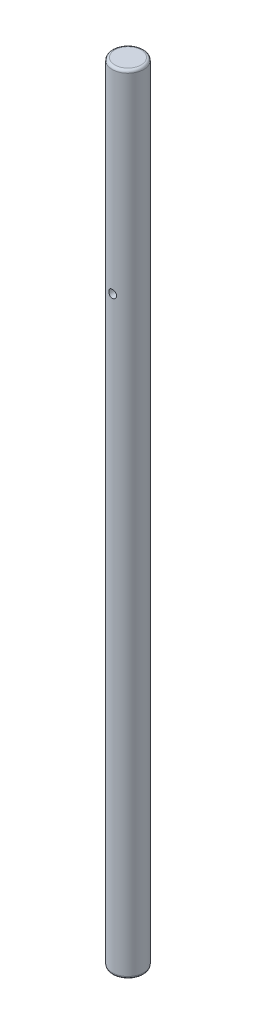
ISO-10303-21;
HEADER;
FILE_DESCRIPTION(('STEP AP214'),'2;1');
FILE_NAME('part.step','',(''),(''),'','','');
FILE_SCHEMA(('AUTOMOTIVE_DESIGN { 1 0 10303 214 1 1 1 1 }'));
ENDSEC;
DATA;
#1=APPLICATION_CONTEXT('core data for automotive mechanical design processes');
#2=APPLICATION_PROTOCOL_DEFINITION('international standard','automotive_design',2000,#1);
#3=PRODUCT_CONTEXT('',#1,'mechanical');
#4=PRODUCT('Part','Part','',(#3));
#5=PRODUCT_RELATED_PRODUCT_CATEGORY('part','',(#4));
#6=PRODUCT_DEFINITION_FORMATION('','',#4);
#7=PRODUCT_DEFINITION_CONTEXT('part definition',#1,'design');
#8=PRODUCT_DEFINITION('design','',#6,#7);
#9=PRODUCT_DEFINITION_SHAPE('','',#8);
#10=(LENGTH_UNIT() NAMED_UNIT(*) SI_UNIT(.MILLI.,.METRE.));
#11=(NAMED_UNIT(*) PLANE_ANGLE_UNIT() SI_UNIT($,.RADIAN.));
#12=(NAMED_UNIT(*) SI_UNIT($,.STERADIAN.) SOLID_ANGLE_UNIT());
#13=UNCERTAINTY_MEASURE_WITH_UNIT(LENGTH_MEASURE(1.E-05),#10,'distance_accuracy_value','');
#14=(GEOMETRIC_REPRESENTATION_CONTEXT(3) GLOBAL_UNCERTAINTY_ASSIGNED_CONTEXT((#13)) GLOBAL_UNIT_ASSIGNED_CONTEXT((#10,
#11,#12)) REPRESENTATION_CONTEXT('',''));
#15=CARTESIAN_POINT('',(0.,0.,0.));
#16=DIRECTION('',(0.,0.,1.));
#17=DIRECTION('',(1.,0.,0.));
#18=AXIS2_PLACEMENT_3D('',#15,#16,#17);
#19=CARTESIAN_POINT('',(0.,300.,0.));
#20=DIRECTION('',(0.,-1.,0.));
#21=DIRECTION('',(0.,0.,-1.));
#22=AXIS2_PLACEMENT_3D('',#19,#20,#21);
#23=CYLINDRICAL_SURFACE('',#22,6.);
#24=CARTESIAN_POINT('',(0.,226.5,-6.));
#25=CARTESIAN_POINT('',(-0.0828760886697318,226.499997674262,-5.99999859868013));
#26=CARTESIAN_POINT('',(-0.165778157830765,226.493108449226,-5.99826578131828));
#27=CARTESIAN_POINT('',(-0.329206323770534,226.465774848693,-5.99152113829892));
#28=CARTESIAN_POINT('',(-0.409731046870738,226.445322790462,-5.98650745419968));
#29=CARTESIAN_POINT('',(-0.566020872182574,226.391560746538,-5.9737562633204));
#30=CARTESIAN_POINT('',(-0.64179156343,226.358266201285,-5.96602202842087));
#31=CARTESIAN_POINT('',(-0.786672131904421,226.279818609955,-5.94865343807593));
#32=CARTESIAN_POINT('',(-0.855781784348752,226.234665163881,-5.93901901854051));
#33=CARTESIAN_POINT('',(-0.986801927300911,226.132799210346,-5.91867413591801));
#34=CARTESIAN_POINT('',(-1.04855569006106,226.075888425041,-5.90794707148533));
#35=CARTESIAN_POINT('',(-1.1617489272033,225.952547795091,-5.8867362011753));
#36=CARTESIAN_POINT('',(-1.21318723694913,225.886116877054,-5.87625242288349));
#37=CARTESIAN_POINT('',(-1.30502654279903,225.744404773263,-5.85654775699711));
#38=CARTESIAN_POINT('',(-1.34525221592535,225.66900676919,-5.84734794470605));
#39=CARTESIAN_POINT('',(-1.41239690855053,225.512251588342,-5.83149494812223));
#40=CARTESIAN_POINT('',(-1.43931805543933,225.430895366674,-5.82484135672789));
#41=CARTESIAN_POINT('',(-1.47855483680429,225.266256501798,-5.81500476717551));
#42=CARTESIAN_POINT('',(-1.49115226833334,225.18304510395,-5.81175491075426));
#43=CARTESIAN_POINT('',(-1.50226177506785,225.015631430986,-5.80889362537741));
#44=CARTESIAN_POINT('',(-1.50077614181798,224.931429319301,-5.80928160448644));
#45=CARTESIAN_POINT('',(-1.48398652463928,224.766584192255,-5.81359205496618));
#46=CARTESIAN_POINT('',(-1.46901834019052,224.685904378535,-5.81742863001879));
#47=CARTESIAN_POINT('',(-1.4262241869031,224.528238949089,-5.82806709676484));
#48=CARTESIAN_POINT('',(-1.39839730206941,224.451253596971,-5.83486919970697));
#49=CARTESIAN_POINT('',(-1.33038947793714,224.302261983748,-5.85075113904187));
#50=CARTESIAN_POINT('',(-1.29008666723289,224.23031382821,-5.85985327469422));
#51=CARTESIAN_POINT('',(-1.19835627601494,224.094081290243,-5.87929710846386));
#52=CARTESIAN_POINT('',(-1.14692674880883,224.029798251933,-5.88963902334736));
#53=CARTESIAN_POINT('',(-1.03266342468121,223.908796384306,-5.91075880539781));
#54=CARTESIAN_POINT('',(-0.969546258165863,223.852345509939,-5.92154069477971));
#55=CARTESIAN_POINT('',(-0.834611917503708,223.750778757536,-5.94205965578786));
#56=CARTESIAN_POINT('',(-0.76279447770795,223.705663225736,-5.95179669549415));
#57=CARTESIAN_POINT('',(-0.612115888681398,223.627949413776,-5.96917732094183));
#58=CARTESIAN_POINT('',(-0.533231393208632,223.595394659746,-5.97681360127725));
#59=CARTESIAN_POINT('',(-0.37087600814289,223.54408269429,-5.98907916991418));
#60=CARTESIAN_POINT('',(-0.287405999150489,223.525322843582,-5.99370903339281));
#61=CARTESIAN_POINT('',(-0.120539970390027,223.502542434441,-5.99935499271375));
#62=CARTESIAN_POINT('',(-0.0371967199882095,223.498156973925,-6.00046053508279));
#63=CARTESIAN_POINT('',(0.129032874801509,223.503249002055,-5.99918804814451));
#64=CARTESIAN_POINT('',(0.211919259644596,223.512725242799,-5.99681033241847));
#65=CARTESIAN_POINT('',(0.373614268776496,223.544970908391,-5.98889581127357));
#66=CARTESIAN_POINT('',(0.452465118968762,223.567541263477,-5.98340634185811));
#67=CARTESIAN_POINT('',(0.605257292452516,223.625107084028,-5.96988706634134));
#68=CARTESIAN_POINT('',(0.679198119032633,223.660103804313,-5.96185700369892));
#69=CARTESIAN_POINT('',(0.821523134429846,223.742236128875,-5.9439330792631));
#70=CARTESIAN_POINT('',(0.889785441835833,223.789576112397,-5.93400867366932));
#71=CARTESIAN_POINT('',(1.01752661364325,223.894789908797,-5.91344509187419));
#72=CARTESIAN_POINT('',(1.07700395897301,223.952665539617,-5.90280579251705));
#73=CARTESIAN_POINT('',(1.18699056807274,224.079001960844,-5.88168956960771));
#74=CARTESIAN_POINT('',(1.23724386762204,224.147687703002,-5.87122304187281));
#75=CARTESIAN_POINT('',(1.3255107590127,224.292732634466,-5.85192878377239));
#76=CARTESIAN_POINT('',(1.36352489415793,224.36909148296,-5.84310098067026));
#77=CARTESIAN_POINT('',(1.42595142060929,224.526905722413,-5.82818094734665));
#78=CARTESIAN_POINT('',(1.45044439665407,224.608327628344,-5.82207255291906));
#79=CARTESIAN_POINT('',(1.48534565995378,224.774309637889,-5.81326744090184));
#80=CARTESIAN_POINT('',(1.49575702747866,224.858869051032,-5.81056997719936));
#81=CARTESIAN_POINT('',(1.50203859033399,225.026121023855,-5.80894901203957));
#82=CARTESIAN_POINT('',(1.49831789778012,225.108797435125,-5.80991932728264));
#83=CARTESIAN_POINT('',(1.47737727831287,225.272303888668,-5.81527909007843));
#84=CARTESIAN_POINT('',(1.46015762268677,225.353133968014,-5.81966846891857));
#85=CARTESIAN_POINT('',(1.4129313194428,225.510208459065,-5.83131260682722));
#86=CARTESIAN_POINT('',(1.38300140468038,225.58647730524,-5.83855015236309));
#87=CARTESIAN_POINT('',(1.31126491360508,225.732965382714,-5.85507755724829));
#88=CARTESIAN_POINT('',(1.2694566900342,225.803183773187,-5.86436770120773));
#89=CARTESIAN_POINT('',(1.17386774863714,225.937554629002,-5.88425634263512));
#90=CARTESIAN_POINT('',(1.11980316291225,226.001501073424,-5.89488264831757));
#91=CARTESIAN_POINT('',(1.00178937118973,226.119547044795,-5.91608027246286));
#92=CARTESIAN_POINT('',(0.937837821261152,226.173644230113,-5.9266515772706));
#93=CARTESIAN_POINT('',(0.800467586702602,226.271411308565,-5.94677655647663));
#94=CARTESIAN_POINT('',(0.726898422316394,226.314874613672,-5.95630833365868));
#95=CARTESIAN_POINT('',(0.573266059510476,226.388747462941,-5.97304924975118));
#96=CARTESIAN_POINT('',(0.493207563436736,226.419166360649,-5.98026005199781));
#97=CARTESIAN_POINT('',(0.344410253243465,226.46157183033,-5.99048059565542));
#98=CARTESIAN_POINT('',(0.276380170908064,226.475951243053,-5.99402585052691));
#99=CARTESIAN_POINT('',(0.138906071536282,226.495165943622,-5.99878605231948));
#100=CARTESIAN_POINT('',(0.0694621612426156,226.500001949305,-6.00000117450894));
#101=CARTESIAN_POINT('',(0.,226.5,-6.));
#102=B_SPLINE_CURVE_WITH_KNOTS('',3,(#24,#25,#26,#27,#28,#29,#30,#31,#32,#33,#34,#35,#36,#37,
#38,#39,#40,#41,#42,#43,#44,#45,#46,#47,#48,#49,#50,#51,#52,#53,#54,#55,#56,#57,#58,#59,#60,#61,
#62,#63,#64,#65,#66,#67,#68,#69,#70,#71,#72,#73,#74,#75,#76,#77,#78,#79,#80,#81,#82,#83,#84,#85,
#86,#87,#88,#89,#90,#91,#92,#93,#94,#95,#96,#97,#98,#99,#100,#101),.UNSPECIFIED.,.T.,.F.,(4,2,2,
2,2,2,2,2,2,2,2,2,2,2,2,2,2,2,2,2,2,2,2,2,2,2,2,2,2,2,2,2,2,2,2,2,2,2,4),(0.,0.248373712471893,
0.496888237763898,0.745104902286102,0.99332994016932,1.24614435437138,1.49898729580059,
1.75558647545805,2.01214461169368,2.26356295099429,2.51494038112698,2.76022497007018,
3.00552703466042,3.25330527873884,3.50112690836164,3.75601500969019,4.01091089558247,
4.26668229009114,4.52240473688643,4.77158308949277,5.02073901112744,5.26620274514039,
5.51169127322291,5.76153587565354,6.01142363008018,6.26744509204478,6.52345518749508,
6.77792254614037,7.03233423252407,7.27943780398613,7.52653640956035,7.77216400559448,
8.017825681369,8.26989576409913,8.52202569770417,8.77872185499588,9.03523363821352,
9.2434224294215,9.4515955604304),.UNSPECIFIED.);
#103=CARTESIAN_POINT('',(0.,226.5,-6.));
#104=VERTEX_POINT('',#103);
#105=EDGE_CURVE('E10',#104,#104,#102,.T.);
#106=ORIENTED_EDGE('',*,*,#105,.T.);
#107=EDGE_LOOP('',(#106));
#108=FACE_BOUND('',#107,.T.);
#109=CARTESIAN_POINT('',(1.5,225.,5.80947501931113));
#110=CARTESIAN_POINT('',(1.49999764715507,224.917169549445,5.80947660051185));
#111=CARTESIAN_POINT('',(1.49311574729838,224.834313060793,5.81126583608348));
#112=CARTESIAN_POINT('',(1.46581387527848,224.670979453096,5.81821117195949));
#113=CARTESIAN_POINT('',(1.44538602404532,224.590503747319,5.82336923173088));
#114=CARTESIAN_POINT('',(1.39169471977917,224.434317877088,5.8364323475758));
#115=CARTESIAN_POINT('',(1.35844783671267,224.358601706769,5.84433385614245));
#116=CARTESIAN_POINT('',(1.28011268475683,224.213813488476,5.86198915217285));
#117=CARTESIAN_POINT('',(1.23502391313641,224.144741722752,5.87174301827102));
#118=CARTESIAN_POINT('',(1.13322505638712,224.013683012843,5.89224429813367));
#119=CARTESIAN_POINT('',(1.07630213262242,223.95186383979,5.90300758573818));
#120=CARTESIAN_POINT('',(0.952909238460388,223.838543163384,5.92417725309179));
#121=CARTESIAN_POINT('',(0.886438376508174,223.787042624627,5.93458359939834));
#122=CARTESIAN_POINT('',(0.744687120647369,223.695134719421,5.95404249312349));
#123=CARTESIAN_POINT('',(0.669296745717076,223.654892167103,5.96307412440355));
#124=CARTESIAN_POINT('',(0.512557910575671,223.587714213508,5.9785848715559));
#125=CARTESIAN_POINT('',(0.431210331475179,223.560776848851,5.98506436400607));
#126=CARTESIAN_POINT('',(0.266615255252512,223.521511299253,5.99462855308908));
#127=CARTESIAN_POINT('',(0.183439631729399,223.508898213404,5.99777936306589));
#128=CARTESIAN_POINT('',(0.0160972915576683,223.497744972435,6.00056156464379));
#129=CARTESIAN_POINT('',(-0.0680692767228397,223.499202736674,6.00019347658022));
#130=CARTESIAN_POINT('',(-0.233028370758579,223.51594491015,5.99602856972121));
#131=CARTESIAN_POINT('',(-0.313854323401594,223.530921795032,5.99230801404524));
#132=CARTESIAN_POINT('',(-0.471807371120523,223.573782762029,5.98194501914913));
#133=CARTESIAN_POINT('',(-0.548934269055655,223.601667531226,5.97530242439065));
#134=CARTESIAN_POINT('',(-0.698110055252709,223.669801542412,5.95972505820537));
#135=CARTESIAN_POINT('',(-0.770106764649752,223.710160226797,5.95077011817032));
#136=CARTESIAN_POINT('',(-0.906413433510724,223.80201340747,5.9315394228579));
#137=CARTESIAN_POINT('',(-0.970722052628249,223.853509841136,5.92126343791494));
#138=CARTESIAN_POINT('',(-1.09166105262743,223.967825245189,5.90018228261712));
#139=CARTESIAN_POINT('',(-1.1480365186128,224.030912935409,5.88937031715551));
#140=CARTESIAN_POINT('',(-1.24946456394453,224.165759984124,5.86869026110024));
#141=CARTESIAN_POINT('',(-1.29451661406903,224.237519747695,5.85882221463582));
#142=CARTESIAN_POINT('',(-1.3721821935339,224.388174020489,5.84112298098989));
#143=CARTESIAN_POINT('',(-1.40473435045574,224.467101438188,5.83330190235432));
#144=CARTESIAN_POINT('',(-1.45602843095451,224.629551280846,5.82071184083974));
#145=CARTESIAN_POINT('',(-1.47477330982936,224.71307271839,5.81594220486131));
#146=CARTESIAN_POINT('',(-1.4974977831991,224.879975700914,5.81013213623485));
#147=CARTESIAN_POINT('',(-1.50185428435178,224.963302675998,5.80899653456189));
#148=CARTESIAN_POINT('',(-1.49671019430933,225.129493161947,5.81032406088624));
#149=CARTESIAN_POINT('',(-1.48721087870928,225.212356714771,5.8127868576076));
#150=CARTESIAN_POINT('',(-1.4549552783626,225.373868558973,5.82094249172736));
#151=CARTESIAN_POINT('',(-1.43241844096904,225.452563635943,5.82658182140625));
#152=CARTESIAN_POINT('',(-1.37497084900237,225.605058874711,5.84040430962578));
#153=CARTESIAN_POINT('',(-1.34005862862752,225.678858455433,5.84858776949168));
#154=CARTESIAN_POINT('',(-1.25806240076192,225.82106476672,5.86677682255958));
#155=CARTESIAN_POINT('',(-1.21075305230136,225.889337304026,5.87681501163985));
#156=CARTESIAN_POINT('',(-1.10559043940167,226.017113017681,5.8975024984303));
#157=CARTESIAN_POINT('',(-1.04773544220815,226.07661474999,5.90815189637082));
#158=CARTESIAN_POINT('',(-0.921394081477086,226.186686625543,5.92918441818964));
#159=CARTESIAN_POINT('',(-0.852677928797386,226.236996037529,5.93955421237102));
#160=CARTESIAN_POINT('',(-0.707554024042015,226.325361520171,5.95858329968241));
#161=CARTESIAN_POINT('',(-0.631146673436393,226.363418229965,5.96724268202376));
#162=CARTESIAN_POINT('',(-0.473337302596646,226.425867620717,5.98182069442988));
#163=CARTESIAN_POINT('',(-0.391976071541833,226.450358570627,5.98775898013446));
#164=CARTESIAN_POINT('',(-0.22612464047822,226.485276200765,5.99631176037473));
#165=CARTESIAN_POINT('',(-0.141635047561871,226.495705595243,5.99892689636045));
#166=CARTESIAN_POINT('',(0.0256252896649866,226.502051384363,6.00051254113217));
#167=CARTESIAN_POINT('',(0.108380740449047,226.498352563643,5.99957968320012));
#168=CARTESIAN_POINT('',(0.272051244622108,226.477428259058,5.99438844686136));
#169=CARTESIAN_POINT('',(0.352966352671329,226.46020317748,5.99013016735643));
#170=CARTESIAN_POINT('',(0.510256553467218,226.412921670344,5.97878149280944));
#171=CARTESIAN_POINT('',(0.586653741871517,226.382934820028,5.97170646753999));
#172=CARTESIAN_POINT('',(0.733375579562191,226.311044131471,5.95546933370077));
#173=CARTESIAN_POINT('',(0.80369946189757,226.269138790996,5.94630696206605));
#174=CARTESIAN_POINT('',(0.938102892635843,226.173427149004,5.92660874522));
#175=CARTESIAN_POINT('',(1.00199248245087,226.119359785639,5.91604525418417));
#176=CARTESIAN_POINT('',(1.11992253040688,226.001365722039,5.89485973579863));
#177=CARTESIAN_POINT('',(1.17396048760228,225.937436525853,5.88423769428834));
#178=CARTESIAN_POINT('',(1.27164303971884,225.800097878698,5.86391213790822));
#179=CARTESIAN_POINT('',(1.31507492916981,225.726533814881,5.85422945594827));
#180=CARTESIAN_POINT('',(1.38889034492349,225.572916765116,5.83715933325924));
#181=CARTESIAN_POINT('',(1.41928336463957,225.49286855084,5.82977022370054));
#182=CARTESIAN_POINT('',(1.46163379284816,225.34413448226,5.81927863109675));
#183=CARTESIAN_POINT('',(1.47598975589307,225.276160253424,5.8156299450082));
#184=CARTESIAN_POINT('',(1.4951734388599,225.1387966965,5.81072757878358));
#185=CARTESIAN_POINT('',(1.50000197155828,225.069407489632,5.80947369434945));
#186=CARTESIAN_POINT('',(1.5,225.,5.80947501931113));
#187=B_SPLINE_CURVE_WITH_KNOTS('',3,(#109,#110,#111,#112,#113,#114,#115,#116,#117,#118,#119,
#120,#121,#122,#123,#124,#125,#126,#127,#128,#129,#130,#131,#132,#133,#134,#135,#136,#137,#138,
#139,#140,#141,#142,#143,#144,#145,#146,#147,#148,#149,#150,#151,#152,#153,#154,#155,#156,#157,
#158,#159,#160,#161,#162,#163,#164,#165,#166,#167,#168,#169,#170,#171,#172,#173,#174,#175,#176,
#177,#178,#179,#180,#181,#182,#183,#184,#185,#186),.UNSPECIFIED.,.T.,.F.,(4,2,2,2,2,2,2,2,2,2,2,
2,2,2,2,2,2,2,2,2,2,2,2,2,2,2,2,2,2,2,2,2,2,2,2,2,2,2,4),(0.,0.248236465041684,
0.496617444857199,0.744678436299644,0.992749960532891,1.24574372515788,1.49876112887921,
1.75530897838752,2.01181895908254,2.26313250597207,2.51440889199613,2.76010957613368,
3.00582334034871,3.25375724552667,3.50173431281348,3.75642279943147,4.01112318719882,
4.26705859205044,4.52293920077728,4.77206144857031,5.02116076310283,5.26618443005527,
5.51123712852855,5.76109707515498,6.01099811331029,6.26715198579192,6.52329249431732,
6.77755243684157,7.03176329345423,7.27910067676475,7.52643070426189,7.77242925935826,
8.01845883442844,8.27038257949241,8.52237018939306,8.77905886370804,9.03556032819971,
9.24358696306397,9.45159585059714),.UNSPECIFIED.);
#188=CARTESIAN_POINT('',(1.5,225.,5.80947501931113));
#189=VERTEX_POINT('',#188);
#190=EDGE_CURVE('E43',#189,#189,#187,.T.);
#191=ORIENTED_EDGE('',*,*,#190,.T.);
#192=EDGE_LOOP('',(#191));
#193=FACE_BOUND('',#192,.T.);
#194=CARTESIAN_POINT('',(0.,1.,0.));
#195=DIRECTION('',(0.,1.,0.));
#196=DIRECTION('',(0.,0.,1.));
#197=AXIS2_PLACEMENT_3D('',#194,#195,#196);
#198=CIRCLE('',#197,6.);
#199=CARTESIAN_POINT('',(0.,1.,6.));
#200=VERTEX_POINT('',#199);
#201=EDGE_CURVE('E118',#200,#200,#198,.T.);
#202=ORIENTED_EDGE('',*,*,#201,.T.);
#203=EDGE_LOOP('',(#202));
#204=FACE_BOUND('',#203,.T.);
#205=CARTESIAN_POINT('',(0.,299.,0.));
#206=DIRECTION('',(0.,1.,0.));
#207=DIRECTION('',(0.,0.,1.));
#208=AXIS2_PLACEMENT_3D('',#205,#206,#207);
#209=CIRCLE('',#208,6.);
#210=CARTESIAN_POINT('',(0.,299.,6.));
#211=VERTEX_POINT('',#210);
#212=EDGE_CURVE('E91',#211,#211,#209,.F.);
#213=ORIENTED_EDGE('',*,*,#212,.T.);
#214=EDGE_LOOP('',(#213));
#215=FACE_BOUND('',#214,.T.);
#216=CARTESIAN_POINT('',(0.,6.50000000000001,-6.));
#217=CARTESIAN_POINT('',(-0.0828760886697309,6.49999767426185,-5.99999859868013));
#218=CARTESIAN_POINT('',(-0.165778157830763,6.49310844922621,-5.99826578131828));
#219=CARTESIAN_POINT('',(-0.329206323770532,6.46577484869299,-5.99152113829892));
#220=CARTESIAN_POINT('',(-0.409731046870739,6.44532279046215,-5.98650745419968));
#221=CARTESIAN_POINT('',(-0.566020872182577,6.39156074653791,-5.9737562633204));
#222=CARTESIAN_POINT('',(-0.641791563430003,6.35826620128472,-5.96602202842087));
#223=CARTESIAN_POINT('',(-0.786672131904427,6.27981860995517,-5.94865343807593));
#224=CARTESIAN_POINT('',(-0.855781784348759,6.23466516388106,-5.9390190185405));
#225=CARTESIAN_POINT('',(-0.98680192730092,6.13279921034579,-5.91867413591801));
#226=CARTESIAN_POINT('',(-1.04855569006107,6.07588842504082,-5.90794707148533));
#227=CARTESIAN_POINT('',(-1.1617489272033,5.95254779509108,-5.8867362011753));
#228=CARTESIAN_POINT('',(-1.21318723694913,5.8861168770535,-5.87625242288348));
#229=CARTESIAN_POINT('',(-1.30502654279903,5.74440477326256,-5.8565477569971));
#230=CARTESIAN_POINT('',(-1.34525221592536,5.6690067691896,-5.84734794470605));
#231=CARTESIAN_POINT('',(-1.41239690855053,5.51225158834164,-5.83149494812223));
#232=CARTESIAN_POINT('',(-1.43931805543933,5.43089536667424,-5.82484135672789));
#233=CARTESIAN_POINT('',(-1.47855483680429,5.26625650179753,-5.81500476717551));
#234=CARTESIAN_POINT('',(-1.49115226833334,5.1830451039502,-5.81175491075426));
#235=CARTESIAN_POINT('',(-1.50226177506785,5.01563143098602,-5.80889362537741));
#236=CARTESIAN_POINT('',(-1.50077614181798,4.93142931930139,-5.80928160448644));
#237=CARTESIAN_POINT('',(-1.48398652463928,4.76658419225552,-5.81359205496618));
#238=CARTESIAN_POINT('',(-1.46901834019052,4.6859043785349,-5.81742863001879));
#239=CARTESIAN_POINT('',(-1.42622418690311,4.52823894908871,-5.82806709676484));
#240=CARTESIAN_POINT('',(-1.39839730206942,4.45125359697102,-5.83486919970696));
#241=CARTESIAN_POINT('',(-1.33038947793715,4.30226198374793,-5.85075113904187));
#242=CARTESIAN_POINT('',(-1.29008666723291,4.23031382821045,-5.85985327469421));
#243=CARTESIAN_POINT('',(-1.19835627601495,4.09408129024316,-5.87929710846386));
#244=CARTESIAN_POINT('',(-1.14692674880884,4.02979825193274,-5.88963902334735));
#245=CARTESIAN_POINT('',(-1.03266342468122,3.9087963843056,-5.91075880539781));
#246=CARTESIAN_POINT('',(-0.96954625816586,3.85234550993865,-5.92154069477971));
#247=CARTESIAN_POINT('',(-0.8346119175037,3.7507787575361,-5.94205965578786));
#248=CARTESIAN_POINT('',(-0.762794477707944,3.70566322573643,-5.95179669549415));
#249=CARTESIAN_POINT('',(-0.612115888681392,3.62794941377561,-5.96917732094183));
#250=CARTESIAN_POINT('',(-0.533231393208624,3.59539465974557,-5.97681360127725));
#251=CARTESIAN_POINT('',(-0.370876008142883,3.54408269429043,-5.98907916991419));
#252=CARTESIAN_POINT('',(-0.287405999150485,3.52532284358186,-5.99370903339281));
#253=CARTESIAN_POINT('',(-0.120539970390027,3.50254243444116,-5.99935499271375));
#254=CARTESIAN_POINT('',(-0.0371967199882099,3.4981569739247,-6.00046053508279));
#255=CARTESIAN_POINT('',(0.129032874801508,3.50324900205549,-5.99918804814451));
#256=CARTESIAN_POINT('',(0.211919259644595,3.51272524279913,-5.99681033241847));
#257=CARTESIAN_POINT('',(0.373614268776491,3.54497090839138,-5.98889581127357));
#258=CARTESIAN_POINT('',(0.452465118968754,3.56754126347699,-5.98340634185811));
#259=CARTESIAN_POINT('',(0.605257292452511,3.62510708402845,-5.96988706634134));
#260=CARTESIAN_POINT('',(0.679198119032634,3.66010380431317,-5.96185700369892));
#261=CARTESIAN_POINT('',(0.821523134429847,3.74223612887473,-5.94393307926311));
#262=CARTESIAN_POINT('',(0.88978544183583,3.78957611239676,-5.93400867366932));
#263=CARTESIAN_POINT('',(1.01752661364325,3.89478990879697,-5.91344509187419));
#264=CARTESIAN_POINT('',(1.07700395897301,3.95266553961691,-5.90280579251705));
#265=CARTESIAN_POINT('',(1.18699056807273,4.07900196084446,-5.88168956960771));
#266=CARTESIAN_POINT('',(1.23724386762203,4.14768770300242,-5.87122304187281));
#267=CARTESIAN_POINT('',(1.3255107590127,4.29273263446572,-5.85192878377239));
#268=CARTESIAN_POINT('',(1.36352489415794,4.36909148295975,-5.84310098067026));
#269=CARTESIAN_POINT('',(1.42595142060929,4.52690572241308,-5.82818094734665));
#270=CARTESIAN_POINT('',(1.45044439665406,4.60832762834401,-5.82207255291906));
#271=CARTESIAN_POINT('',(1.48534565995378,4.77430963788911,-5.81326744090184));
#272=CARTESIAN_POINT('',(1.49575702747866,4.85886905103249,-5.81056997719936));
#273=CARTESIAN_POINT('',(1.50203859033399,5.0261210238552,-5.80894901203957));
#274=CARTESIAN_POINT('',(1.49831789778012,5.10879743512473,-5.80991932728264));
#275=CARTESIAN_POINT('',(1.47737727831287,5.27230388866798,-5.81527909007843));
#276=CARTESIAN_POINT('',(1.46015762268677,5.35313396801365,-5.81966846891857));
#277=CARTESIAN_POINT('',(1.41293131944279,5.51020845906541,-5.83131260682722));
#278=CARTESIAN_POINT('',(1.38300140468038,5.58647730524021,-5.83855015236309));
#279=CARTESIAN_POINT('',(1.31126491360507,5.73296538271369,-5.85507755724829));
#280=CARTESIAN_POINT('',(1.26945669003419,5.80318377318691,-5.86436770120773));
#281=CARTESIAN_POINT('',(1.17386774863714,5.93755462900202,-5.88425634263512));
#282=CARTESIAN_POINT('',(1.11980316291225,6.00150107342396,-5.89488264831757));
#283=CARTESIAN_POINT('',(1.00178937118974,6.11954704479541,-5.91608027246286));
#284=CARTESIAN_POINT('',(0.937837821261146,6.17364423011297,-5.9266515772706));
#285=CARTESIAN_POINT('',(0.80046758670259,6.27141130856461,-5.94677655647663));
#286=CARTESIAN_POINT('',(0.726898422316387,6.31487461367158,-5.95630833365868));
#287=CARTESIAN_POINT('',(0.573266059510477,6.38874746294053,-5.97304924975118));
#288=CARTESIAN_POINT('',(0.49320756343674,6.41916636064854,-5.98026005199781));
#289=CARTESIAN_POINT('',(0.344410253243472,6.46157183032965,-5.99048059565542));
#290=CARTESIAN_POINT('',(0.276380170908068,6.47595124305343,-5.99402585052691));
#291=CARTESIAN_POINT('',(0.138906071536283,6.49516594362194,-5.99878605231948));
#292=CARTESIAN_POINT('',(0.069462161242616,6.50000194930531,-6.00000117450894));
#293=CARTESIAN_POINT('',(0.,6.50000000000001,-6.));
#294=B_SPLINE_CURVE_WITH_KNOTS('',3,(#216,#217,#218,#219,#220,#221,#222,#223,#224,#225,#226,
#227,#228,#229,#230,#231,#232,#233,#234,#235,#236,#237,#238,#239,#240,#241,#242,#243,#244,#245,
#246,#247,#248,#249,#250,#251,#252,#253,#254,#255,#256,#257,#258,#259,#260,#261,#262,#263,#264,
#265,#266,#267,#268,#269,#270,#271,#272,#273,#274,#275,#276,#277,#278,#279,#280,#281,#282,#283,
#284,#285,#286,#287,#288,#289,#290,#291,#292,#293),.UNSPECIFIED.,.T.,.F.,(4,2,2,2,2,2,2,2,2,2,2,
2,2,2,2,2,2,2,2,2,2,2,2,2,2,2,2,2,2,2,2,2,2,2,2,2,2,2,4),(0.,0.24837371247189,0.4968882377639,
0.745104902286107,0.993329940169328,1.24614435437139,1.49898729580062,1.75558647545807,
2.01214461169368,2.2635629509943,2.51494038112697,2.76022497007018,3.00552703466038,
3.25330527873879,3.50112690836163,3.75601500969019,4.01091089558247,4.26668229009114,
4.52240473688643,4.77158308949276,5.02073901112743,5.26620274514037,5.51169127322291,
5.76153587565352,6.01142363008019,6.26744509204476,6.52345518749508,6.77792254614036,
7.03233423252408,7.27943780398613,7.52653640956034,7.77216400559447,8.01782568136901,
8.2698957640991,8.52202569770418,8.77872185499588,9.0352336382135,9.24342242942149,
9.4515955604304),.UNSPECIFIED.);
#295=CARTESIAN_POINT('',(0.,6.50000000000001,-6.));
#296=VERTEX_POINT('',#295);
#297=EDGE_CURVE('E82',#296,#296,#294,.T.);
#298=ORIENTED_EDGE('',*,*,#297,.T.);
#299=EDGE_LOOP('',(#298));
#300=FACE_BOUND('',#299,.T.);
#301=ADVANCED_FACE('F31',(#108,#193,#204,#215,#300),#23,.T.);
#302=CARTESIAN_POINT('',(0.,300.,0.));
#303=DIRECTION('',(0.,1.,0.));
#304=DIRECTION('',(0.,0.,1.));
#305=AXIS2_PLACEMENT_3D('',#302,#303,#304);
#306=PLANE('',#305);
#307=CARTESIAN_POINT('',(0.,300.,0.));
#308=DIRECTION('',(0.,1.,0.));
#309=DIRECTION('',(0.,0.,1.));
#310=AXIS2_PLACEMENT_3D('',#307,#308,#309);
#311=CIRCLE('',#310,5.);
#312=CARTESIAN_POINT('',(0.,300.,5.));
#313=VERTEX_POINT('',#312);
#314=EDGE_CURVE('E47',#313,#313,#311,.T.);
#315=ORIENTED_EDGE('',*,*,#314,.T.);
#316=EDGE_LOOP('',(#315));
#317=FACE_BOUND('',#316,.T.);
#318=ADVANCED_FACE('F99',(#317),#306,.T.);
#319=CARTESIAN_POINT('',(0.,0.,0.));
#320=DIRECTION('',(0.,1.,0.));
#321=DIRECTION('',(0.,0.,1.));
#322=AXIS2_PLACEMENT_3D('',#319,#320,#321);
#323=PLANE('',#322);
#324=CARTESIAN_POINT('',(0.,0.,0.));
#325=DIRECTION('',(0.,1.,0.));
#326=DIRECTION('',(0.,0.,1.));
#327=AXIS2_PLACEMENT_3D('',#324,#325,#326);
#328=CIRCLE('',#327,5.);
#329=CARTESIAN_POINT('',(0.,0.,5.));
#330=VERTEX_POINT('',#329);
#331=EDGE_CURVE('E51',#330,#330,#328,.F.);
#332=ORIENTED_EDGE('',*,*,#331,.T.);
#333=EDGE_LOOP('',(#332));
#334=FACE_BOUND('',#333,.T.);
#335=CARTESIAN_POINT('',(0.,0.,0.));
#336=DIRECTION('',(0.,-1.,0.));
#337=DIRECTION('',(0.,0.,-1.));
#338=AXIS2_PLACEMENT_3D('',#335,#336,#337);
#339=CIRCLE('',#338,2.5);
#340=CARTESIAN_POINT('',(0.,0.,-2.5));
#341=VERTEX_POINT('',#340);
#342=EDGE_CURVE('E88',#341,#341,#339,.T.);
#343=ORIENTED_EDGE('',*,*,#342,.F.);
#344=EDGE_LOOP('',(#343));
#345=FACE_BOUND('',#344,.T.);
#346=ADVANCED_FACE('F97',(#334,#345),#323,.F.);
#347=CARTESIAN_POINT('',(0.,20.,0.));
#348=DIRECTION('',(0.,-1.,0.));
#349=DIRECTION('',(0.,0.,-1.));
#350=AXIS2_PLACEMENT_3D('',#347,#348,#349);
#351=CYLINDRICAL_SURFACE('',#350,2.5);
#352=CARTESIAN_POINT('',(0.,6.5,-2.5));
#353=CARTESIAN_POINT('',(0.0767298334620157,6.49999590899012,-2.49999625789732));
#354=CARTESIAN_POINT('',(0.153582320644178,6.49407132907374,-2.4964290461501));
#355=CARTESIAN_POINT('',(0.304975509530679,6.47067568048467,-2.48249903608568));
#356=CARTESIAN_POINT('',(0.379510034596047,6.45317613814578,-2.47211948032719));
#357=CARTESIAN_POINT('',(0.523751827790837,6.40761363883315,-2.44561558054488));
#358=CARTESIAN_POINT('',(0.593481028226566,6.37960304183684,-2.42951973272944));
#359=CARTESIAN_POINT('',(0.727030318214659,6.31413966685897,-2.39295367626407));
#360=CARTESIAN_POINT('',(0.790851869416383,6.27668923303125,-2.37248455380255));
#361=CARTESIAN_POINT('',(0.916299278999315,6.19022517329142,-2.32705360719088));
#362=CARTESIAN_POINT('',(0.977384020081415,6.14054630464861,-2.30186792195985));
#363=CARTESIAN_POINT('',(1.09088270411891,6.03253279617173,-2.25030439279634));
#364=CARTESIAN_POINT('',(1.14328534948112,5.97418706281268,-2.22392505153571));
#365=CARTESIAN_POINT('',(1.24444996762974,5.84207648950327,-2.1691106699591));
#366=CARTESIAN_POINT('',(1.29197766378809,5.76729822901871,-2.14082017703649));
#367=CARTESIAN_POINT('',(1.37361437764896,5.60915342675689,-2.08938301412124));
#368=CARTESIAN_POINT('',(1.4077451733516,5.52580110375243,-2.06622802273938));
#369=CARTESIAN_POINT('',(1.45440601714221,5.37340354934676,-2.0335462966093));
#370=CARTESIAN_POINT('',(1.47016197246826,5.30576400138968,-2.02207883137591));
#371=CARTESIAN_POINT('',(1.49216172340475,5.16819628416964,-2.00590308295503));
#372=CARTESIAN_POINT('',(1.49841734556836,5.09827107124551,-2.00118639643759));
#373=CARTESIAN_POINT('',(1.50105508796009,4.95798850578266,-1.99920922463856));
#374=CARTESIAN_POINT('',(1.49741783408419,4.8876305749068,-2.00196337012718));
#375=CARTESIAN_POINT('',(1.48046060478828,4.74872122457241,-2.01453261443741));
#376=CARTESIAN_POINT('',(1.46713334620103,4.68017120415256,-2.02435302432226));
#377=CARTESIAN_POINT('',(1.43173921881792,4.54746975787189,-2.04953186944258));
#378=CARTESIAN_POINT('',(1.40978748666087,4.48327294607552,-2.06481711652537));
#379=CARTESIAN_POINT('',(1.35795061770837,4.35930500907188,-2.09927051350828));
#380=CARTESIAN_POINT('',(1.32806257259705,4.29953551657607,-2.11844008623465));
#381=CARTESIAN_POINT('',(1.25517983184583,4.1750159028772,-2.16255327268985));
#382=CARTESIAN_POINT('',(1.21080724397723,4.11122190704507,-2.18792043372992));
#383=CARTESIAN_POINT('',(1.11291092784003,3.99132351633298,-2.23930599764381));
#384=CARTESIAN_POINT('',(1.05937845100579,3.93522656602349,-2.26532500262149));
#385=CARTESIAN_POINT('',(0.935811834382966,3.82438701817824,-2.31935504958317));
#386=CARTESIAN_POINT('',(0.864517682704956,3.77092269398401,-2.34713836268532));
#387=CARTESIAN_POINT('',(0.712276050458999,3.67687795280209,-2.39772428433981));
#388=CARTESIAN_POINT('',(0.631333763943563,3.63629064621005,-2.42052955425515));
#389=CARTESIAN_POINT('',(0.467197585268205,3.5720678172041,-2.45730392066151));
#390=CARTESIAN_POINT('',(0.38446762417358,3.54752464428409,-2.47173957439704));
#391=CARTESIAN_POINT('',(0.215047895144639,3.51298880259462,-2.49218842813551));
#392=CARTESIAN_POINT('',(0.128363005661319,3.50297868224642,-2.49821172952738));
#393=CARTESIAN_POINT('',(-0.0337146143773964,3.49849215232169,-2.5009057037461));
#394=CARTESIAN_POINT('',(-0.109042473418718,3.50209114491483,-2.49873521714286));
#395=CARTESIAN_POINT('',(-0.25782940198606,3.52042585307192,-2.48778712087048));
#396=CARTESIAN_POINT('',(-0.331288509376106,3.53516134280581,-2.47900964518037));
#397=CARTESIAN_POINT('',(-0.472574932157613,3.57454343281246,-2.4559479244219));
#398=CARTESIAN_POINT('',(-0.540495750928484,3.59894034907347,-2.44180275662555));
#399=CARTESIAN_POINT('',(-0.671265749087263,3.65667737636527,-2.40913880862844));
#400=CARTESIAN_POINT('',(-0.734113924963908,3.69001925134667,-2.39061916586511));
#401=CARTESIAN_POINT('',(-0.860006262823863,3.76855697920871,-2.3484549623736));
#402=CARTESIAN_POINT('',(-0.922394150456837,3.81462382907839,-2.3244780273988));
#403=CARTESIAN_POINT('',(-1.03902603131014,3.91539139348862,-2.27474265574732));
#404=CARTESIAN_POINT('',(-1.09326040273738,3.97010215485254,-2.2489821658636));
#405=CARTESIAN_POINT('',(-1.19931996735579,4.09491039003715,-2.19445423909891));
#406=CARTESIAN_POINT('',(-1.24991019630915,4.1660838854655,-2.16573241746291));
#407=CARTESIAN_POINT('',(-1.33845238915667,4.3172160245682,-2.1121618206671));
#408=CARTESIAN_POINT('',(-1.37641766769781,4.39716529389278,-2.0873089799769));
#409=CARTESIAN_POINT('',(-1.43142578795776,4.54624302230669,-2.04984909240519));
#410=CARTESIAN_POINT('',(-1.4512162533619,4.61398031235859,-2.03575659328729));
#411=CARTESIAN_POINT('',(-1.48113663905972,4.7525320780801,-2.01409605743544));
#412=CARTESIAN_POINT('',(-1.49127995297631,4.82334214432783,-2.00651897642721));
#413=CARTESIAN_POINT('',(-1.50134130416631,4.96637694759703,-1.99900446616268));
#414=CARTESIAN_POINT('',(-1.50122089107869,5.03860599068704,-1.99909576445937));
#415=CARTESIAN_POINT('',(-1.49066472959328,5.18189443560946,-2.0069771789285));
#416=CARTESIAN_POINT('',(-1.48022337215759,5.25295318008059,-2.0147714813882));
#417=CARTESIAN_POINT('',(-1.45040174148913,5.38848841757219,-2.0363318524298));
#418=CARTESIAN_POINT('',(-1.43147636845351,5.45311709430687,-2.04979211805581));
#419=CARTESIAN_POINT('',(-1.38563242076993,5.57833725447422,-2.08105501960151));
#420=CARTESIAN_POINT('',(-1.35871083588479,5.63892720696055,-2.09885929040482));
#421=CARTESIAN_POINT('',(-1.29289245555733,5.76431985722078,-2.14012990550916));
#422=CARTESIAN_POINT('',(-1.25279167675753,5.82834110385431,-2.16404587582639));
#423=CARTESIAN_POINT('',(-1.16375698389085,5.94938007261729,-2.21320127030768));
#424=CARTESIAN_POINT('',(-1.11481579607798,6.00639196215256,-2.23844177205021));
#425=CARTESIAN_POINT('',(-1.00009777425734,6.12135094913167,-2.29225690291476));
#426=CARTESIAN_POINT('',(-0.932876819313906,6.17793107489619,-2.32070308663658));
#427=CARTESIAN_POINT('',(-0.788462434445591,6.2790978558633,-2.37365428872367));
#428=CARTESIAN_POINT('',(-0.711265444501542,6.32368021198479,-2.39815789310936));
#429=CARTESIAN_POINT('',(-0.551125230801456,6.39778580757374,-2.43985578654394));
#430=CARTESIAN_POINT('',(-0.468430086957216,6.42772806492683,-2.45725077479787));
#431=CARTESIAN_POINT('',(-0.29797330611881,6.47272469521097,-2.48366273001246));
#432=CARTESIAN_POINT('',(-0.210232099648614,6.48783516785699,-2.49271125871485));
#433=CARTESIAN_POINT('',(-0.101558096917538,6.49669745470866,-2.49802001168187));
#434=CARTESIAN_POINT('',(-0.0812762590282795,6.4979344173061,-2.49876114656362));
#435=CARTESIAN_POINT('',(-0.0406658206871137,6.49958624637086,-2.49975164517367));
#436=CARTESIAN_POINT('',(-0.0203372186375701,6.5000010843209,-2.50000099184316));
#437=CARTESIAN_POINT('',(0.,6.5,-2.5));
#438=B_SPLINE_CURVE_WITH_KNOTS('',3,(#352,#353,#354,#355,#356,#357,#358,#359,#360,#361,#362,
#363,#364,#365,#366,#367,#368,#369,#370,#371,#372,#373,#374,#375,#376,#377,#378,#379,#380,#381,
#382,#383,#384,#385,#386,#387,#388,#389,#390,#391,#392,#393,#394,#395,#396,#397,#398,#399,#400,
#401,#402,#403,#404,#405,#406,#407,#408,#409,#410,#411,#412,#413,#414,#415,#416,#417,#418,#419,
#420,#421,#422,#423,#424,#425,#426,#427,#428,#429,#430,#431,#432,#433,#434,#435,#436,#437),
.UNSPECIFIED.,.T.,.F.,(4,2,2,2,2,2,2,2,2,2,2,2,2,2,2,2,2,2,2,2,2,2,2,2,2,2,2,2,2,2,2,2,2,2,2,2,
2,2,2,2,2,2,4),(0.,0.230102237548649,0.460772627520012,0.690308884600012,0.919788197992275,
1.16681590732473,1.414162579348,1.69183813189807,1.96906040692092,2.17933829855633,
2.38935420916578,2.59978170870726,2.81036753273872,3.01823267593207,3.22617409809868,
3.47046995225163,3.71500044803674,3.99360957884691,4.27206939275324,4.53296790696559,
4.79355286918236,5.01875602722426,5.24395461863455,5.46367785689772,5.68344445659025,
5.92601365818362,6.16886690081836,6.44336762428009,6.71757792616456,6.93257787314692,
7.14727888733318,7.36278425777433,7.57840681155725,7.78364098331142,7.98895251523034,
8.22578610052286,8.46281544370207,8.73854311775518,9.01436946031984,9.28175654462676,
9.54812832184447,9.60911473335176,9.6701032602764),.UNSPECIFIED.);
#439=CARTESIAN_POINT('',(0.,6.5,-2.5));
#440=VERTEX_POINT('',#439);
#441=EDGE_CURVE('E75',#440,#440,#438,.T.);
#442=ORIENTED_EDGE('',*,*,#441,.T.);
#443=EDGE_LOOP('',(#442));
#444=FACE_BOUND('',#443,.T.);
#445=CARTESIAN_POINT('',(0.,20.,0.));
#446=DIRECTION('',(0.,-1.,0.));
#447=DIRECTION('',(0.,0.,-1.));
#448=AXIS2_PLACEMENT_3D('',#445,#446,#447);
#449=CIRCLE('',#448,2.5);
#450=CARTESIAN_POINT('',(0.,20.,-2.5));
#451=VERTEX_POINT('',#450);
#452=EDGE_CURVE('E89',#451,#451,#449,.T.);
#453=ORIENTED_EDGE('',*,*,#452,.F.);
#454=EDGE_LOOP('',(#453));
#455=FACE_BOUND('',#454,.T.);
#456=ORIENTED_EDGE('',*,*,#342,.T.);
#457=EDGE_LOOP('',(#456));
#458=FACE_BOUND('',#457,.T.);
#459=ADVANCED_FACE('F95',(#444,#455,#458),#351,.F.);
#460=CARTESIAN_POINT('',(0.,20.,0.));
#461=DIRECTION('',(0.,-1.,0.));
#462=DIRECTION('',(0.,0.,-1.));
#463=AXIS2_PLACEMENT_3D('',#460,#461,#462);
#464=PLANE('',#463);
#465=ORIENTED_EDGE('',*,*,#452,.T.);
#466=EDGE_LOOP('',(#465));
#467=FACE_BOUND('',#466,.T.);
#468=ADVANCED_FACE('F70',(#467),#464,.T.);
#469=CARTESIAN_POINT('',(0.,5.,-20.));
#470=DIRECTION('',(0.,0.,1.));
#471=DIRECTION('',(1.,0.,0.));
#472=AXIS2_PLACEMENT_3D('',#469,#470,#471);
#473=CYLINDRICAL_SURFACE('',#472,1.5);
#474=ORIENTED_EDGE('',*,*,#441,.F.);
#475=EDGE_LOOP('',(#474));
#476=FACE_BOUND('',#475,.T.);
#477=ORIENTED_EDGE('',*,*,#297,.F.);
#478=EDGE_LOOP('',(#477));
#479=FACE_BOUND('',#478,.T.);
#480=ADVANCED_FACE('F64',(#476,#479),#473,.F.);
#481=CARTESIAN_POINT('',(0.,1.,0.));
#482=DIRECTION('',(0.,1.,0.));
#483=DIRECTION('',(0.,0.,1.));
#484=AXIS2_PLACEMENT_3D('',#481,#482,#483);
#485=TOROIDAL_SURFACE('',#484,5.,1.);
#486=ORIENTED_EDGE('',*,*,#331,.F.);
#487=EDGE_LOOP('',(#486));
#488=FACE_BOUND('',#487,.T.);
#489=ORIENTED_EDGE('',*,*,#201,.F.);
#490=EDGE_LOOP('',(#489));
#491=FACE_BOUND('',#490,.T.);
#492=ADVANCED_FACE('F69',(#488,#491),#485,.T.);
#493=CARTESIAN_POINT('',(0.,299.,0.));
#494=DIRECTION('',(0.,1.,0.));
#495=DIRECTION('',(0.,0.,1.));
#496=AXIS2_PLACEMENT_3D('',#493,#494,#495);
#497=TOROIDAL_SURFACE('',#496,5.,1.);
#498=ORIENTED_EDGE('',*,*,#212,.F.);
#499=EDGE_LOOP('',(#498));
#500=FACE_BOUND('',#499,.T.);
#501=ORIENTED_EDGE('',*,*,#314,.F.);
#502=EDGE_LOOP('',(#501));
#503=FACE_BOUND('',#502,.T.);
#504=ADVANCED_FACE('F33',(#500,#503),#497,.T.);
#505=CARTESIAN_POINT('',(0.,225.,-6.));
#506=DIRECTION('',(0.,0.,1.));
#507=DIRECTION('',(1.,0.,0.));
#508=AXIS2_PLACEMENT_3D('',#505,#506,#507);
#509=CYLINDRICAL_SURFACE('',#508,1.5);
#510=ORIENTED_EDGE('',*,*,#190,.F.);
#511=EDGE_LOOP('',(#510));
#512=FACE_BOUND('',#511,.T.);
#513=ORIENTED_EDGE('',*,*,#105,.F.);
#514=EDGE_LOOP('',(#513));
#515=FACE_BOUND('',#514,.T.);
#516=ADVANCED_FACE('F59',(#512,#515),#509,.F.);
#517=CLOSED_SHELL('',(#301,#318,#346,#459,#468,#480,#492,#504,#516));
#518=MANIFOLD_SOLID_BREP('B2',#517);
#519=ADVANCED_BREP_SHAPE_REPRESENTATION('',(#18,#518),#14);
#520=SHAPE_DEFINITION_REPRESENTATION(#9,#519);
ENDSEC;
END-ISO-10303-21;
